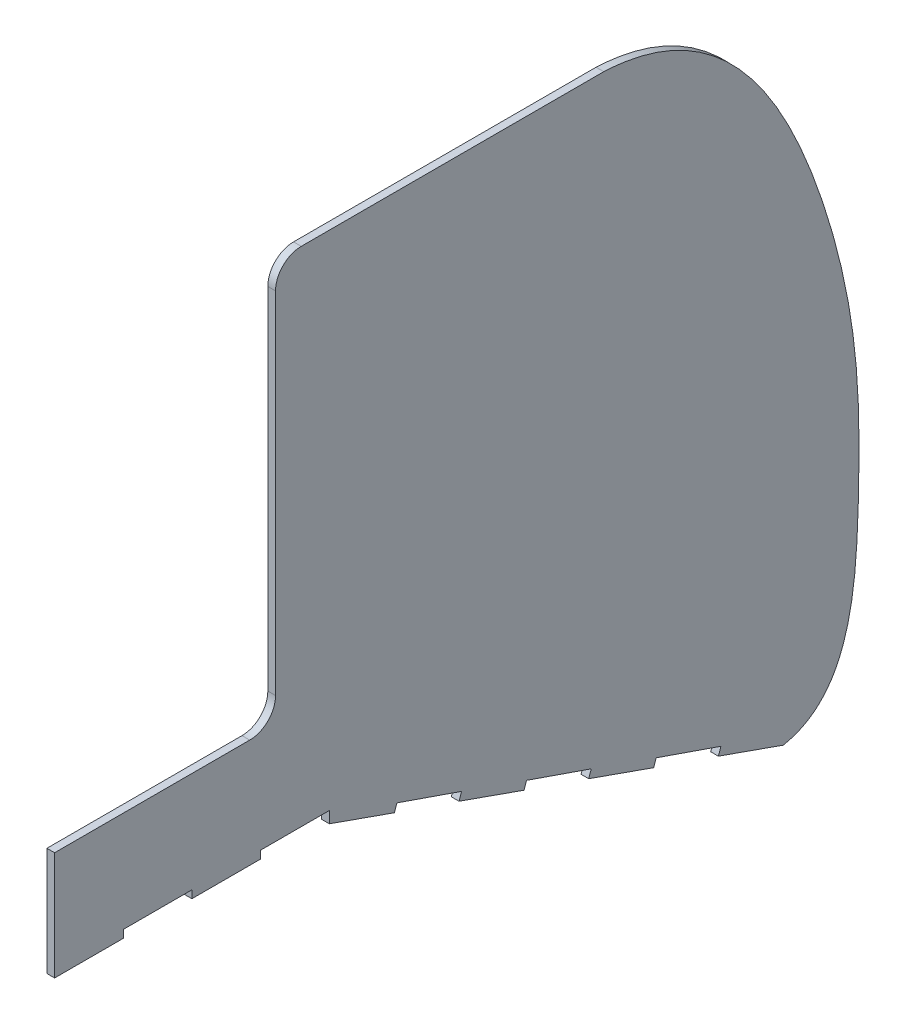
ISO-10303-21;
HEADER;
FILE_DESCRIPTION(('STEP AP214'),'2;1');
FILE_NAME('part.step','',(''),(''),'','','');
FILE_SCHEMA(('AUTOMOTIVE_DESIGN { 1 0 10303 214 1 1 1 1 }'));
ENDSEC;
DATA;
#1=APPLICATION_CONTEXT('core data for automotive mechanical design processes');
#2=APPLICATION_PROTOCOL_DEFINITION('international standard','automotive_design',2000,#1);
#3=PRODUCT_CONTEXT('',#1,'mechanical');
#4=PRODUCT('Part','Part','',(#3));
#5=PRODUCT_RELATED_PRODUCT_CATEGORY('part','',(#4));
#6=PRODUCT_DEFINITION_FORMATION('','',#4);
#7=PRODUCT_DEFINITION_CONTEXT('part definition',#1,'design');
#8=PRODUCT_DEFINITION('design','',#6,#7);
#9=PRODUCT_DEFINITION_SHAPE('','',#8);
#10=(LENGTH_UNIT() NAMED_UNIT(*) SI_UNIT(.MILLI.,.METRE.));
#11=(NAMED_UNIT(*) PLANE_ANGLE_UNIT() SI_UNIT($,.RADIAN.));
#12=(NAMED_UNIT(*) SI_UNIT($,.STERADIAN.) SOLID_ANGLE_UNIT());
#13=UNCERTAINTY_MEASURE_WITH_UNIT(LENGTH_MEASURE(1.E-05),#10,'distance_accuracy_value','');
#14=(GEOMETRIC_REPRESENTATION_CONTEXT(3) GLOBAL_UNCERTAINTY_ASSIGNED_CONTEXT((#13)) GLOBAL_UNIT_ASSIGNED_CONTEXT((#10,
#11,#12)) REPRESENTATION_CONTEXT('',''));
#15=CARTESIAN_POINT('',(0.,0.,0.));
#16=DIRECTION('',(0.,0.,1.));
#17=DIRECTION('',(1.,0.,0.));
#18=AXIS2_PLACEMENT_3D('',#15,#16,#17);
#19=CARTESIAN_POINT('',(3.,-35.4908915205804,4.87556999777367));
#20=DIRECTION('',(0.,-0.326907719308166,-0.945056264492614));
#21=DIRECTION('',(0.,0.945056264492614,-0.326907719308166));
#22=AXIS2_PLACEMENT_3D('',#19,#20,#21);
#23=PLANE('',#22);
#24=DIRECTION('',(0.,-0.945056264492614,0.326907719308166));
#25=VECTOR('',#24,1.);
#26=CARTESIAN_POINT('',(0.,-35.4908915205804,4.87556999777367));
#27=LINE('',#26,#25);
#28=CARTESIAN_POINT('',(0.,-35.4908915205804,4.87556999777367));
#29=VERTEX_POINT('',#28);
#30=CARTESIAN_POINT('',(0.,-38.3260603140583,5.85629315569817));
#31=VERTEX_POINT('',#30);
#32=EDGE_CURVE('E257',#29,#31,#27,.T.);
#33=ORIENTED_EDGE('',*,*,#32,.T.);
#34=DIRECTION('',(-1.,0.,0.));
#35=VECTOR('',#34,1.);
#36=CARTESIAN_POINT('',(3.,-38.3260603140583,5.85629315569817));
#37=LINE('',#36,#35);
#38=CARTESIAN_POINT('',(3.,-38.3260603140583,5.85629315569817));
#39=VERTEX_POINT('',#38);
#40=EDGE_CURVE('E11',#39,#31,#37,.T.);
#41=ORIENTED_EDGE('',*,*,#40,.F.);
#42=DIRECTION('',(0.,-0.945056264492614,0.326907719308166));
#43=VECTOR('',#42,1.);
#44=CARTESIAN_POINT('',(3.,-35.4908915205804,4.87556999777367));
#45=LINE('',#44,#43);
#46=CARTESIAN_POINT('',(3.,-35.4908915205804,4.87556999777367));
#47=VERTEX_POINT('',#46);
#48=EDGE_CURVE('E316',#47,#39,#45,.T.);
#49=ORIENTED_EDGE('',*,*,#48,.F.);
#50=DIRECTION('',(-1.,0.,0.));
#51=VECTOR('',#50,1.);
#52=CARTESIAN_POINT('',(3.,-35.4908915205804,4.87556999777367));
#53=LINE('',#52,#51);
#54=EDGE_CURVE('E253',#47,#29,#53,.T.);
#55=ORIENTED_EDGE('',*,*,#54,.T.);
#56=EDGE_LOOP('',(#33,#41,#49,#55));
#57=FACE_BOUND('',#56,.T.);
#58=ADVANCED_FACE('F41',(#57),#23,.F.);
#59=CARTESIAN_POINT('',(3.,-38.3260603140583,5.85629315569817));
#60=DIRECTION('',(0.,0.942978575575048,-0.332853430215842));
#61=DIRECTION('',(0.,0.332853430215842,0.942978575575049));
#62=AXIS2_PLACEMENT_3D('',#59,#60,#61);
#63=PLANE('',#62);
#64=DIRECTION('',(0.,-0.332853430215842,-0.942978575575048));
#65=VECTOR('',#64,1.);
#66=CARTESIAN_POINT('',(0.,-38.3260603140583,5.85629315569817));
#67=LINE('',#66,#65);
#68=CARTESIAN_POINT('',(0.,-47.2453418621063,-19.4121603010595));
#69=VERTEX_POINT('',#68);
#70=EDGE_CURVE('E260',#31,#69,#67,.T.);
#71=ORIENTED_EDGE('',*,*,#70,.T.);
#72=DIRECTION('',(-1.,0.,0.));
#73=VECTOR('',#72,1.);
#74=CARTESIAN_POINT('',(3.,-47.2453418621063,-19.4121603010595));
#75=LINE('',#74,#73);
#76=CARTESIAN_POINT('',(3.,-47.2453418621063,-19.4121603010595));
#77=VERTEX_POINT('',#76);
#78=EDGE_CURVE('E49',#77,#69,#75,.T.);
#79=ORIENTED_EDGE('',*,*,#78,.F.);
#80=DIRECTION('',(0.,-0.332853430215842,-0.942978575575048));
#81=VECTOR('',#80,1.);
#82=CARTESIAN_POINT('',(3.,-38.3260603140583,5.85629315569817));
#83=LINE('',#82,#81);
#84=EDGE_CURVE('E160',#39,#77,#83,.T.);
#85=ORIENTED_EDGE('',*,*,#84,.F.);
#86=ORIENTED_EDGE('',*,*,#40,.T.);
#87=EDGE_LOOP('',(#71,#79,#85,#86));
#88=FACE_BOUND('',#87,.T.);
#89=ADVANCED_FACE('F442',(#88),#63,.F.);
#90=CARTESIAN_POINT('',(3.,-47.2453418621063,-19.4121603010595));
#91=DIRECTION('',(0.,0.326907719308166,0.945056264492614));
#92=DIRECTION('',(0.,-0.945056264492614,0.326907719308166));
#93=AXIS2_PLACEMENT_3D('',#90,#91,#92);
#94=PLANE('',#93);
#95=DIRECTION('',(0.,0.945056264492614,-0.326907719308166));
#96=VECTOR('',#95,1.);
#97=CARTESIAN_POINT('',(0.,-47.2453418621063,-19.4121603010595));
#98=LINE('',#97,#96);
#99=CARTESIAN_POINT('',(0.,-44.4101730686285,-20.392883458984));
#100=VERTEX_POINT('',#99);
#101=EDGE_CURVE('E262',#69,#100,#98,.T.);
#102=ORIENTED_EDGE('',*,*,#101,.T.);
#103=DIRECTION('',(-1.,0.,0.));
#104=VECTOR('',#103,1.);
#105=CARTESIAN_POINT('',(3.,-44.4101730686285,-20.392883458984));
#106=LINE('',#105,#104);
#107=CARTESIAN_POINT('',(3.,-44.4101730686285,-20.392883458984));
#108=VERTEX_POINT('',#107);
#109=EDGE_CURVE('E383',#108,#100,#106,.T.);
#110=ORIENTED_EDGE('',*,*,#109,.F.);
#111=DIRECTION('',(0.,0.945056264492614,-0.326907719308166));
#112=VECTOR('',#111,1.);
#113=CARTESIAN_POINT('',(3.,-47.2453418621063,-19.4121603010595));
#114=LINE('',#113,#112);
#115=EDGE_CURVE('E391',#77,#108,#114,.T.);
#116=ORIENTED_EDGE('',*,*,#115,.F.);
#117=ORIENTED_EDGE('',*,*,#78,.T.);
#118=EDGE_LOOP('',(#102,#110,#116,#117));
#119=FACE_BOUND('',#118,.T.);
#120=ADVANCED_FACE('F389',(#119),#94,.F.);
#121=CARTESIAN_POINT('',(3.,-44.4101730686285,-20.392883458984));
#122=DIRECTION('',(0.,0.945056264492614,-0.326907719308165));
#123=DIRECTION('',(0.,0.326907719308165,0.945056264492614));
#124=AXIS2_PLACEMENT_3D('',#121,#122,#123);
#125=PLANE('',#124);
#126=DIRECTION('',(0.,-0.326907719308165,-0.945056264492614));
#127=VECTOR('',#126,1.);
#128=CARTESIAN_POINT('',(0.,-44.4101730686285,-20.392883458984));
#129=LINE('',#128,#127);
#130=CARTESIAN_POINT('',(0.,-53.1147946852733,-45.5570405069039));
#131=VERTEX_POINT('',#130);
#132=EDGE_CURVE('E264',#100,#131,#129,.T.);
#133=ORIENTED_EDGE('',*,*,#132,.T.);
#134=DIRECTION('',(-1.,0.,0.));
#135=VECTOR('',#134,1.);
#136=CARTESIAN_POINT('',(3.,-53.1147946852733,-45.5570405069039));
#137=LINE('',#136,#135);
#138=CARTESIAN_POINT('',(3.,-53.1147946852733,-45.5570405069039));
#139=VERTEX_POINT('',#138);
#140=EDGE_CURVE('E380',#139,#131,#137,.T.);
#141=ORIENTED_EDGE('',*,*,#140,.F.);
#142=DIRECTION('',(0.,-0.326907719308165,-0.945056264492614));
#143=VECTOR('',#142,1.);
#144=CARTESIAN_POINT('',(3.,-44.4101730686285,-20.392883458984));
#145=LINE('',#144,#143);
#146=EDGE_CURVE('E409',#108,#139,#145,.T.);
#147=ORIENTED_EDGE('',*,*,#146,.F.);
#148=ORIENTED_EDGE('',*,*,#109,.T.);
#149=EDGE_LOOP('',(#133,#141,#147,#148));
#150=FACE_BOUND('',#149,.T.);
#151=ADVANCED_FACE('F400',(#150),#125,.F.);
#152=CARTESIAN_POINT('',(3.,-53.1147946852733,-45.5570405069039));
#153=DIRECTION('',(0.,-0.326907719308179,-0.945056264492609));
#154=DIRECTION('',(0.,0.945056264492609,-0.32690771930818));
#155=AXIS2_PLACEMENT_3D('',#152,#153,#154);
#156=PLANE('',#155);
#157=DIRECTION('',(0.,-0.945056264492609,0.32690771930818));
#158=VECTOR('',#157,1.);
#159=CARTESIAN_POINT('',(0.,-53.1147946852733,-45.5570405069039));
#160=LINE('',#159,#158);
#161=CARTESIAN_POINT('',(0.,-55.9499634787511,-44.5763173489793));
#162=VERTEX_POINT('',#161);
#163=EDGE_CURVE('E266',#131,#162,#160,.T.);
#164=ORIENTED_EDGE('',*,*,#163,.T.);
#165=DIRECTION('',(-1.,0.,0.));
#166=VECTOR('',#165,1.);
#167=CARTESIAN_POINT('',(3.,-55.9499634787511,-44.5763173489793));
#168=LINE('',#167,#166);
#169=CARTESIAN_POINT('',(3.,-55.9499634787511,-44.5763173489793));
#170=VERTEX_POINT('',#169);
#171=EDGE_CURVE('E377',#170,#162,#168,.T.);
#172=ORIENTED_EDGE('',*,*,#171,.F.);
#173=DIRECTION('',(0.,-0.945056264492609,0.32690771930818));
#174=VECTOR('',#173,1.);
#175=CARTESIAN_POINT('',(3.,-53.1147946852733,-45.5570405069039));
#176=LINE('',#175,#174);
#177=EDGE_CURVE('E406',#139,#170,#176,.T.);
#178=ORIENTED_EDGE('',*,*,#177,.F.);
#179=ORIENTED_EDGE('',*,*,#140,.T.);
#180=EDGE_LOOP('',(#164,#172,#178,#179));
#181=FACE_BOUND('',#180,.T.);
#182=ADVANCED_FACE('F404',(#181),#156,.F.);
#183=CARTESIAN_POINT('',(3.,-55.9499634787511,-44.5763173489793));
#184=DIRECTION('',(0.,0.942978575575048,-0.332853430215842));
#185=DIRECTION('',(0.,0.332853430215842,0.942978575575049));
#186=AXIS2_PLACEMENT_3D('',#183,#184,#185);
#187=PLANE('',#186);
#188=DIRECTION('',(0.,-0.332853430215842,-0.942978575575049));
#189=VECTOR('',#188,1.);
#190=CARTESIAN_POINT('',(0.,-55.9499634787511,-44.5763173489793));
#191=LINE('',#190,#189);
#192=CARTESIAN_POINT('',(0.,-64.8692450267991,-69.844770805737));
#193=VERTEX_POINT('',#192);
#194=EDGE_CURVE('E268',#162,#193,#191,.T.);
#195=ORIENTED_EDGE('',*,*,#194,.T.);
#196=DIRECTION('',(-1.,0.,0.));
#197=VECTOR('',#196,1.);
#198=CARTESIAN_POINT('',(3.,-64.8692450267991,-69.844770805737));
#199=LINE('',#198,#197);
#200=CARTESIAN_POINT('',(3.,-64.8692450267991,-69.844770805737));
#201=VERTEX_POINT('',#200);
#202=EDGE_CURVE('E374',#201,#193,#199,.T.);
#203=ORIENTED_EDGE('',*,*,#202,.F.);
#204=DIRECTION('',(0.,-0.332853430215842,-0.942978575575049));
#205=VECTOR('',#204,1.);
#206=CARTESIAN_POINT('',(3.,-55.9499634787511,-44.5763173489793));
#207=LINE('',#206,#205);
#208=EDGE_CURVE('E408',#170,#201,#207,.T.);
#209=ORIENTED_EDGE('',*,*,#208,.F.);
#210=ORIENTED_EDGE('',*,*,#171,.T.);
#211=EDGE_LOOP('',(#195,#203,#209,#210));
#212=FACE_BOUND('',#211,.T.);
#213=ADVANCED_FACE('F431',(#212),#187,.F.);
#214=CARTESIAN_POINT('',(3.,-64.8692450267991,-69.844770805737));
#215=CARTESIAN_POINT('',(3.,-59.9103879295342,-95.6249766931962));
#216=CARTESIAN_POINT('',(3.,0.303625018277105,-100.05299309198));
#217=CARTESIAN_POINT('',(3.,59.2088369906112,-99.1821701786262));
#218=CARTESIAN_POINT('',(3.,137.404046631828,-79.8848755295219));
#219=CARTESIAN_POINT('',(3.,194.855720742385,-46.196792572307));
#220=CARTESIAN_POINT('',(3.,196.921746015327,0.));
#221=B_SPLINE_CURVE_WITH_KNOTS('',3,(#214,#215,#216,#217,#218,#219,#220),.UNSPECIFIED.,.F.,.F.,
(4,1,1,1,4),(0.,0.235631157854146,0.435765938633693,0.605393772524314,1.),.UNSPECIFIED.);
#222=DIRECTION('',(-1.,0.,0.));
#223=VECTOR('',#222,1.);
#224=SURFACE_OF_LINEAR_EXTRUSION('',#221,#223);
#225=CARTESIAN_POINT('',(0.,-64.8692450267991,-69.844770805737));
#226=CARTESIAN_POINT('',(0.,-59.9103879295342,-95.6249766931962));
#227=CARTESIAN_POINT('',(0.,0.303625018277105,-100.05299309198));
#228=CARTESIAN_POINT('',(0.,59.2088369906112,-99.1821701786262));
#229=CARTESIAN_POINT('',(0.,137.404046631828,-79.8848755295219));
#230=CARTESIAN_POINT('',(0.,194.855720742385,-46.196792572307));
#231=CARTESIAN_POINT('',(0.,196.921746015327,0.));
#232=B_SPLINE_CURVE_WITH_KNOTS('',3,(#225,#226,#227,#228,#229,#230,#231),.UNSPECIFIED.,.F.,.F.,
(4,1,1,1,4),(0.,0.235631157854146,0.435765938633693,0.605393772524314,1.),.UNSPECIFIED.);
#233=CARTESIAN_POINT('',(0.,196.921746015327,0.));
#234=VERTEX_POINT('',#233);
#235=EDGE_CURVE('E270',#193,#234,#232,.T.);
#236=ORIENTED_EDGE('',*,*,#235,.T.);
#237=DIRECTION('',(-1.,0.,0.));
#238=VECTOR('',#237,1.);
#239=CARTESIAN_POINT('',(3.,196.921746015327,0.));
#240=LINE('',#239,#238);
#241=CARTESIAN_POINT('',(3.,196.921746015327,0.));
#242=VERTEX_POINT('',#241);
#243=EDGE_CURVE('E371',#242,#234,#240,.T.);
#244=ORIENTED_EDGE('',*,*,#243,.F.);
#245=EDGE_CURVE('E411',#201,#242,#221,.T.);
#246=ORIENTED_EDGE('',*,*,#245,.F.);
#247=ORIENTED_EDGE('',*,*,#202,.T.);
#248=EDGE_LOOP('',(#236,#244,#246,#247));
#249=FACE_BOUND('',#248,.T.);
#250=ADVANCED_FACE('F426',(#249),#224,.F.);
#251=CARTESIAN_POINT('',(3.,196.921746015327,117.673281540121));
#252=DIRECTION('',(0.,-1.,0.));
#253=DIRECTION('',(0.,0.,-1.));
#254=AXIS2_PLACEMENT_3D('',#251,#252,#253);
#255=PLANE('',#254);
#256=DIRECTION('',(0.,0.,1.));
#257=VECTOR('',#256,1.);
#258=CARTESIAN_POINT('',(0.,196.921746015327,117.673281540121));
#259=LINE('',#258,#257);
#260=CARTESIAN_POINT('',(0.,196.921746015327,117.673281540121));
#261=VERTEX_POINT('',#260);
#262=EDGE_CURVE('E274',#234,#261,#259,.T.);
#263=ORIENTED_EDGE('',*,*,#262,.T.);
#264=DIRECTION('',(-1.,0.,0.));
#265=VECTOR('',#264,1.);
#266=CARTESIAN_POINT('',(3.,196.921746015327,117.673281540121));
#267=LINE('',#266,#265);
#268=CARTESIAN_POINT('',(3.,196.921746015327,117.673281540121));
#269=VERTEX_POINT('',#268);
#270=EDGE_CURVE('E368',#269,#261,#267,.T.);
#271=ORIENTED_EDGE('',*,*,#270,.F.);
#272=DIRECTION('',(0.,0.,1.));
#273=VECTOR('',#272,1.);
#274=CARTESIAN_POINT('',(3.,196.921746015327,117.673281540121));
#275=LINE('',#274,#273);
#276=EDGE_CURVE('E420',#242,#269,#275,.T.);
#277=ORIENTED_EDGE('',*,*,#276,.F.);
#278=ORIENTED_EDGE('',*,*,#243,.T.);
#279=EDGE_LOOP('',(#263,#271,#277,#278));
#280=FACE_BOUND('',#279,.T.);
#281=ADVANCED_FACE('F430',(#280),#255,.F.);
#282=CARTESIAN_POINT('',(3.,186.921746015327,117.673281540121));
#283=DIRECTION('',(-1.,0.,0.));
#284=DIRECTION('',(0.,0.,1.));
#285=AXIS2_PLACEMENT_3D('',#282,#283,#284);
#286=CYLINDRICAL_SURFACE('',#285,10.);
#287=CARTESIAN_POINT('',(0.,186.921746015327,117.673281540121));
#288=DIRECTION('',(1.,0.,0.));
#289=DIRECTION('',(0.,0.,1.));
#290=AXIS2_PLACEMENT_3D('',#287,#288,#289);
#291=CIRCLE('',#290,10.);
#292=CARTESIAN_POINT('',(0.,186.921746015327,127.673281540121));
#293=VERTEX_POINT('',#292);
#294=EDGE_CURVE('E279',#261,#293,#291,.T.);
#295=ORIENTED_EDGE('',*,*,#294,.T.);
#296=DIRECTION('',(-1.,0.,0.));
#297=VECTOR('',#296,1.);
#298=CARTESIAN_POINT('',(3.,186.921746015327,127.673281540121));
#299=LINE('',#298,#297);
#300=CARTESIAN_POINT('',(3.,186.921746015327,127.673281540121));
#301=VERTEX_POINT('',#300);
#302=EDGE_CURVE('E365',#301,#293,#299,.T.);
#303=ORIENTED_EDGE('',*,*,#302,.F.);
#304=CARTESIAN_POINT('',(3.,186.921746015327,117.673281540121));
#305=DIRECTION('',(1.,0.,0.));
#306=DIRECTION('',(0.,0.,1.));
#307=AXIS2_PLACEMENT_3D('',#304,#305,#306);
#308=CIRCLE('',#307,10.);
#309=EDGE_CURVE('E549',#269,#301,#308,.T.);
#310=ORIENTED_EDGE('',*,*,#309,.F.);
#311=ORIENTED_EDGE('',*,*,#270,.T.);
#312=EDGE_LOOP('',(#295,#303,#310,#311));
#313=FACE_BOUND('',#312,.T.);
#314=ADVANCED_FACE('F548',(#313),#286,.T.);
#315=CARTESIAN_POINT('',(3.,50.6216316060485,127.673281540121));
#316=DIRECTION('',(0.,0.,-1.));
#317=DIRECTION('',(0.,1.,0.));
#318=AXIS2_PLACEMENT_3D('',#315,#316,#317);
#319=PLANE('',#318);
#320=DIRECTION('',(0.,-1.,0.));
#321=VECTOR('',#320,1.);
#322=CARTESIAN_POINT('',(0.,50.6216316060485,127.673281540121));
#323=LINE('',#322,#321);
#324=CARTESIAN_POINT('',(0.,50.6216316060485,127.673281540121));
#325=VERTEX_POINT('',#324);
#326=EDGE_CURVE('E281',#293,#325,#323,.T.);
#327=ORIENTED_EDGE('',*,*,#326,.T.);
#328=DIRECTION('',(-1.,0.,0.));
#329=VECTOR('',#328,1.);
#330=CARTESIAN_POINT('',(3.,50.6216316060485,127.673281540121));
#331=LINE('',#330,#329);
#332=CARTESIAN_POINT('',(3.,50.6216316060485,127.673281540121));
#333=VERTEX_POINT('',#332);
#334=EDGE_CURVE('E362',#333,#325,#331,.T.);
#335=ORIENTED_EDGE('',*,*,#334,.F.);
#336=DIRECTION('',(0.,-1.,0.));
#337=VECTOR('',#336,1.);
#338=CARTESIAN_POINT('',(3.,50.6216316060485,127.673281540121));
#339=LINE('',#338,#337);
#340=EDGE_CURVE('E545',#301,#333,#339,.T.);
#341=ORIENTED_EDGE('',*,*,#340,.F.);
#342=ORIENTED_EDGE('',*,*,#302,.T.);
#343=EDGE_LOOP('',(#327,#335,#341,#342));
#344=FACE_BOUND('',#343,.T.);
#345=ADVANCED_FACE('F542',(#344),#319,.F.);
#346=CARTESIAN_POINT('',(3.,50.6216316060485,137.673281540121));
#347=DIRECTION('',(-1.,0.,0.));
#348=DIRECTION('',(0.,0.,1.));
#349=AXIS2_PLACEMENT_3D('',#346,#347,#348);
#350=CYLINDRICAL_SURFACE('',#349,10.);
#351=CARTESIAN_POINT('',(0.,50.6216316060485,137.673281540121));
#352=DIRECTION('',(-1.,0.,0.));
#353=DIRECTION('',(0.,0.,-1.));
#354=AXIS2_PLACEMENT_3D('',#351,#352,#353);
#355=CIRCLE('',#354,10.);
#356=CARTESIAN_POINT('',(0.,40.6217460153273,137.721116386061));
#357=VERTEX_POINT('',#356);
#358=EDGE_CURVE('E283',#325,#357,#355,.T.);
#359=ORIENTED_EDGE('',*,*,#358,.T.);
#360=DIRECTION('',(-1.,0.,0.));
#361=VECTOR('',#360,1.);
#362=CARTESIAN_POINT('',(3.,40.6217460153273,137.721116386061));
#363=LINE('',#362,#361);
#364=CARTESIAN_POINT('',(3.,40.6217460153273,137.721116386061));
#365=VERTEX_POINT('',#364);
#366=EDGE_CURVE('E359',#365,#357,#363,.T.);
#367=ORIENTED_EDGE('',*,*,#366,.F.);
#368=CARTESIAN_POINT('',(3.,50.6216316060485,137.673281540121));
#369=DIRECTION('',(-1.,0.,0.));
#370=DIRECTION('',(0.,0.,-1.));
#371=AXIS2_PLACEMENT_3D('',#368,#369,#370);
#372=CIRCLE('',#371,10.);
#373=EDGE_CURVE('E536',#333,#365,#372,.T.);
#374=ORIENTED_EDGE('',*,*,#373,.F.);
#375=ORIENTED_EDGE('',*,*,#334,.T.);
#376=EDGE_LOOP('',(#359,#367,#374,#375));
#377=FACE_BOUND('',#376,.T.);
#378=ADVANCED_FACE('F535',(#377),#350,.F.);
#379=CARTESIAN_POINT('',(3.,40.6217460153273,213.6));
#380=DIRECTION('',(0.,-1.,0.));
#381=DIRECTION('',(0.,0.,-1.));
#382=AXIS2_PLACEMENT_3D('',#379,#380,#381);
#383=PLANE('',#382);
#384=DIRECTION('',(0.,0.,1.));
#385=VECTOR('',#384,1.);
#386=CARTESIAN_POINT('',(0.,40.6217460153273,213.6));
#387=LINE('',#386,#385);
#388=CARTESIAN_POINT('',(0.,40.6217460153273,213.6));
#389=VERTEX_POINT('',#388);
#390=EDGE_CURVE('E285',#357,#389,#387,.T.);
#391=ORIENTED_EDGE('',*,*,#390,.T.);
#392=DIRECTION('',(-1.,0.,0.));
#393=VECTOR('',#392,1.);
#394=CARTESIAN_POINT('',(3.,40.6217460153273,213.6));
#395=LINE('',#394,#393);
#396=CARTESIAN_POINT('',(3.,40.6217460153273,213.6));
#397=VERTEX_POINT('',#396);
#398=EDGE_CURVE('E356',#397,#389,#395,.T.);
#399=ORIENTED_EDGE('',*,*,#398,.F.);
#400=DIRECTION('',(0.,0.,1.));
#401=VECTOR('',#400,1.);
#402=CARTESIAN_POINT('',(3.,40.6217460153273,213.6));
#403=LINE('',#402,#401);
#404=EDGE_CURVE('E531',#365,#397,#403,.T.);
#405=ORIENTED_EDGE('',*,*,#404,.F.);
#406=ORIENTED_EDGE('',*,*,#366,.T.);
#407=EDGE_LOOP('',(#391,#399,#405,#406));
#408=FACE_BOUND('',#407,.T.);
#409=ADVANCED_FACE('F530',(#408),#383,.F.);
#410=CARTESIAN_POINT('',(3.,-1.5782539846727,213.6));
#411=DIRECTION('',(0.,0.,-1.));
#412=DIRECTION('',(-1.,0.,0.));
#413=AXIS2_PLACEMENT_3D('',#410,#411,#412);
#414=PLANE('',#413);
#415=DIRECTION('',(0.,-1.,0.));
#416=VECTOR('',#415,1.);
#417=CARTESIAN_POINT('',(0.,-1.5782539846727,213.6));
#418=LINE('',#417,#416);
#419=CARTESIAN_POINT('',(0.,-1.5782539846727,213.6));
#420=VERTEX_POINT('',#419);
#421=EDGE_CURVE('E287',#389,#420,#418,.T.);
#422=ORIENTED_EDGE('',*,*,#421,.T.);
#423=DIRECTION('',(-1.,0.,0.));
#424=VECTOR('',#423,1.);
#425=CARTESIAN_POINT('',(3.,-1.5782539846727,213.6));
#426=LINE('',#425,#424);
#427=CARTESIAN_POINT('',(3.,-1.5782539846727,213.6));
#428=VERTEX_POINT('',#427);
#429=EDGE_CURVE('E353',#428,#420,#426,.T.);
#430=ORIENTED_EDGE('',*,*,#429,.F.);
#431=DIRECTION('',(0.,-1.,0.));
#432=VECTOR('',#431,1.);
#433=CARTESIAN_POINT('',(3.,-1.5782539846727,213.6));
#434=LINE('',#433,#432);
#435=EDGE_CURVE('E527',#397,#428,#434,.T.);
#436=ORIENTED_EDGE('',*,*,#435,.F.);
#437=ORIENTED_EDGE('',*,*,#398,.T.);
#438=EDGE_LOOP('',(#422,#430,#436,#437));
#439=FACE_BOUND('',#438,.T.);
#440=ADVANCED_FACE('F524',(#439),#414,.F.);
#441=CARTESIAN_POINT('',(3.,-1.5782539846727,186.9));
#442=DIRECTION('',(0.,1.,0.));
#443=DIRECTION('',(0.,0.,1.));
#444=AXIS2_PLACEMENT_3D('',#441,#442,#443);
#445=PLANE('',#444);
#446=DIRECTION('',(0.,0.,-1.));
#447=VECTOR('',#446,1.);
#448=CARTESIAN_POINT('',(0.,-1.5782539846727,186.9));
#449=LINE('',#448,#447);
#450=CARTESIAN_POINT('',(0.,-1.5782539846727,186.9));
#451=VERTEX_POINT('',#450);
#452=EDGE_CURVE('E289',#420,#451,#449,.T.);
#453=ORIENTED_EDGE('',*,*,#452,.T.);
#454=DIRECTION('',(-1.,0.,0.));
#455=VECTOR('',#454,1.);
#456=CARTESIAN_POINT('',(3.,-1.5782539846727,186.9));
#457=LINE('',#456,#455);
#458=CARTESIAN_POINT('',(3.,-1.5782539846727,186.9));
#459=VERTEX_POINT('',#458);
#460=EDGE_CURVE('E350',#459,#451,#457,.T.);
#461=ORIENTED_EDGE('',*,*,#460,.F.);
#462=DIRECTION('',(0.,0.,-1.));
#463=VECTOR('',#462,1.);
#464=CARTESIAN_POINT('',(3.,-1.5782539846727,186.9));
#465=LINE('',#464,#463);
#466=EDGE_CURVE('E518',#428,#459,#465,.T.);
#467=ORIENTED_EDGE('',*,*,#466,.F.);
#468=ORIENTED_EDGE('',*,*,#429,.T.);
#469=EDGE_LOOP('',(#453,#461,#467,#468));
#470=FACE_BOUND('',#469,.T.);
#471=ADVANCED_FACE('F517',(#470),#445,.F.);
#472=CARTESIAN_POINT('',(3.,1.4217460153273,186.9));
#473=DIRECTION('',(0.,0.,1.));
#474=DIRECTION('',(1.,0.,0.));
#475=AXIS2_PLACEMENT_3D('',#472,#473,#474);
#476=PLANE('',#475);
#477=DIRECTION('',(0.,1.,0.));
#478=VECTOR('',#477,1.);
#479=CARTESIAN_POINT('',(0.,1.4217460153273,186.9));
#480=LINE('',#479,#478);
#481=CARTESIAN_POINT('',(0.,1.4217460153273,186.9));
#482=VERTEX_POINT('',#481);
#483=EDGE_CURVE('E291',#451,#482,#480,.T.);
#484=ORIENTED_EDGE('',*,*,#483,.T.);
#485=DIRECTION('',(-1.,0.,0.));
#486=VECTOR('',#485,1.);
#487=CARTESIAN_POINT('',(3.,1.4217460153273,186.9));
#488=LINE('',#487,#486);
#489=CARTESIAN_POINT('',(3.,1.4217460153273,186.9));
#490=VERTEX_POINT('',#489);
#491=EDGE_CURVE('E347',#490,#482,#488,.T.);
#492=ORIENTED_EDGE('',*,*,#491,.F.);
#493=DIRECTION('',(0.,1.,0.));
#494=VECTOR('',#493,1.);
#495=CARTESIAN_POINT('',(3.,1.4217460153273,186.9));
#496=LINE('',#495,#494);
#497=EDGE_CURVE('E513',#459,#490,#496,.T.);
#498=ORIENTED_EDGE('',*,*,#497,.F.);
#499=ORIENTED_EDGE('',*,*,#460,.T.);
#500=EDGE_LOOP('',(#484,#492,#498,#499));
#501=FACE_BOUND('',#500,.T.);
#502=ADVANCED_FACE('F512',(#501),#476,.F.);
#503=CARTESIAN_POINT('',(3.,1.42174601532731,160.2));
#504=DIRECTION('',(0.,1.,0.));
#505=DIRECTION('',(0.,0.,1.));
#506=AXIS2_PLACEMENT_3D('',#503,#504,#505);
#507=PLANE('',#506);
#508=DIRECTION('',(0.,0.,-1.));
#509=VECTOR('',#508,1.);
#510=CARTESIAN_POINT('',(0.,1.42174601532731,160.2));
#511=LINE('',#510,#509);
#512=CARTESIAN_POINT('',(0.,1.42174601532731,160.2));
#513=VERTEX_POINT('',#512);
#514=EDGE_CURVE('E293',#482,#513,#511,.T.);
#515=ORIENTED_EDGE('',*,*,#514,.T.);
#516=DIRECTION('',(-1.,0.,0.));
#517=VECTOR('',#516,1.);
#518=CARTESIAN_POINT('',(3.,1.42174601532731,160.2));
#519=LINE('',#518,#517);
#520=CARTESIAN_POINT('',(3.,1.42174601532731,160.2));
#521=VERTEX_POINT('',#520);
#522=EDGE_CURVE('E344',#521,#513,#519,.T.);
#523=ORIENTED_EDGE('',*,*,#522,.F.);
#524=DIRECTION('',(0.,0.,-1.));
#525=VECTOR('',#524,1.);
#526=CARTESIAN_POINT('',(3.,1.42174601532731,160.2));
#527=LINE('',#526,#525);
#528=EDGE_CURVE('E509',#490,#521,#527,.T.);
#529=ORIENTED_EDGE('',*,*,#528,.F.);
#530=ORIENTED_EDGE('',*,*,#491,.T.);
#531=EDGE_LOOP('',(#515,#523,#529,#530));
#532=FACE_BOUND('',#531,.T.);
#533=ADVANCED_FACE('F506',(#532),#507,.F.);
#534=CARTESIAN_POINT('',(3.,-1.57825398467269,160.2));
#535=DIRECTION('',(0.,0.,-1.));
#536=DIRECTION('',(-1.,0.,0.));
#537=AXIS2_PLACEMENT_3D('',#534,#535,#536);
#538=PLANE('',#537);
#539=DIRECTION('',(0.,-1.,0.));
#540=VECTOR('',#539,1.);
#541=CARTESIAN_POINT('',(0.,-1.57825398467269,160.2));
#542=LINE('',#541,#540);
#543=CARTESIAN_POINT('',(0.,-1.57825398467269,160.2));
#544=VERTEX_POINT('',#543);
#545=EDGE_CURVE('E295',#513,#544,#542,.T.);
#546=ORIENTED_EDGE('',*,*,#545,.T.);
#547=DIRECTION('',(-1.,0.,0.));
#548=VECTOR('',#547,1.);
#549=CARTESIAN_POINT('',(3.,-1.57825398467269,160.2));
#550=LINE('',#549,#548);
#551=CARTESIAN_POINT('',(3.,-1.57825398467269,160.2));
#552=VERTEX_POINT('',#551);
#553=EDGE_CURVE('E341',#552,#544,#550,.T.);
#554=ORIENTED_EDGE('',*,*,#553,.F.);
#555=DIRECTION('',(0.,-1.,0.));
#556=VECTOR('',#555,1.);
#557=CARTESIAN_POINT('',(3.,-1.57825398467269,160.2));
#558=LINE('',#557,#556);
#559=EDGE_CURVE('E500',#521,#552,#558,.T.);
#560=ORIENTED_EDGE('',*,*,#559,.F.);
#561=ORIENTED_EDGE('',*,*,#522,.T.);
#562=EDGE_LOOP('',(#546,#554,#560,#561));
#563=FACE_BOUND('',#562,.T.);
#564=ADVANCED_FACE('F499',(#563),#538,.F.);
#565=CARTESIAN_POINT('',(3.,-1.57825398467269,133.5));
#566=DIRECTION('',(0.,1.,0.));
#567=DIRECTION('',(0.,0.,1.));
#568=AXIS2_PLACEMENT_3D('',#565,#566,#567);
#569=PLANE('',#568);
#570=DIRECTION('',(0.,0.,-1.));
#571=VECTOR('',#570,1.);
#572=CARTESIAN_POINT('',(0.,-1.57825398467269,133.5));
#573=LINE('',#572,#571);
#574=CARTESIAN_POINT('',(0.,-1.57825398467269,133.5));
#575=VERTEX_POINT('',#574);
#576=EDGE_CURVE('E297',#544,#575,#573,.T.);
#577=ORIENTED_EDGE('',*,*,#576,.T.);
#578=DIRECTION('',(-1.,0.,0.));
#579=VECTOR('',#578,1.);
#580=CARTESIAN_POINT('',(3.,-1.57825398467269,133.5));
#581=LINE('',#580,#579);
#582=CARTESIAN_POINT('',(3.,-1.57825398467269,133.5));
#583=VERTEX_POINT('',#582);
#584=EDGE_CURVE('E338',#583,#575,#581,.T.);
#585=ORIENTED_EDGE('',*,*,#584,.F.);
#586=DIRECTION('',(0.,0.,-1.));
#587=VECTOR('',#586,1.);
#588=CARTESIAN_POINT('',(3.,-1.57825398467269,133.5));
#589=LINE('',#588,#587);
#590=EDGE_CURVE('E495',#552,#583,#589,.T.);
#591=ORIENTED_EDGE('',*,*,#590,.F.);
#592=ORIENTED_EDGE('',*,*,#553,.T.);
#593=EDGE_LOOP('',(#577,#585,#591,#592));
#594=FACE_BOUND('',#593,.T.);
#595=ADVANCED_FACE('F494',(#594),#569,.F.);
#596=CARTESIAN_POINT('',(3.,1.42174601532731,133.5));
#597=DIRECTION('',(0.,0.,1.));
#598=DIRECTION('',(1.,0.,0.));
#599=AXIS2_PLACEMENT_3D('',#596,#597,#598);
#600=PLANE('',#599);
#601=DIRECTION('',(0.,1.,0.));
#602=VECTOR('',#601,1.);
#603=CARTESIAN_POINT('',(0.,1.42174601532731,133.5));
#604=LINE('',#603,#602);
#605=CARTESIAN_POINT('',(0.,1.42174601532731,133.5));
#606=VERTEX_POINT('',#605);
#607=EDGE_CURVE('E299',#575,#606,#604,.T.);
#608=ORIENTED_EDGE('',*,*,#607,.T.);
#609=DIRECTION('',(-1.,0.,0.));
#610=VECTOR('',#609,1.);
#611=CARTESIAN_POINT('',(3.,1.42174601532731,133.5));
#612=LINE('',#611,#610);
#613=CARTESIAN_POINT('',(3.,1.42174601532731,133.5));
#614=VERTEX_POINT('',#613);
#615=EDGE_CURVE('E335',#614,#606,#612,.T.);
#616=ORIENTED_EDGE('',*,*,#615,.F.);
#617=DIRECTION('',(0.,1.,0.));
#618=VECTOR('',#617,1.);
#619=CARTESIAN_POINT('',(3.,1.42174601532731,133.5));
#620=LINE('',#619,#618);
#621=EDGE_CURVE('E491',#583,#614,#620,.T.);
#622=ORIENTED_EDGE('',*,*,#621,.F.);
#623=ORIENTED_EDGE('',*,*,#584,.T.);
#624=EDGE_LOOP('',(#608,#616,#622,#623));
#625=FACE_BOUND('',#624,.T.);
#626=ADVANCED_FACE('F488',(#625),#600,.F.);
#627=CARTESIAN_POINT('',(3.,1.42174601532731,106.721514165053));
#628=DIRECTION('',(0.,1.,0.));
#629=DIRECTION('',(0.,0.,1.));
#630=AXIS2_PLACEMENT_3D('',#627,#628,#629);
#631=PLANE('',#630);
#632=DIRECTION('',(0.,0.,-1.));
#633=VECTOR('',#632,1.);
#634=CARTESIAN_POINT('',(0.,1.42174601532731,106.721514165053));
#635=LINE('',#634,#633);
#636=CARTESIAN_POINT('',(0.,1.42174601532731,106.721514165053));
#637=VERTEX_POINT('',#636);
#638=EDGE_CURVE('E301',#606,#637,#635,.T.);
#639=ORIENTED_EDGE('',*,*,#638,.T.);
#640=DIRECTION('',(-1.,0.,0.));
#641=VECTOR('',#640,1.);
#642=CARTESIAN_POINT('',(3.,1.42174601532731,106.721514165053));
#643=LINE('',#642,#641);
#644=CARTESIAN_POINT('',(3.,1.42174601532731,106.721514165053));
#645=VERTEX_POINT('',#644);
#646=EDGE_CURVE('E332',#645,#637,#643,.T.);
#647=ORIENTED_EDGE('',*,*,#646,.F.);
#648=DIRECTION('',(0.,0.,-1.));
#649=VECTOR('',#648,1.);
#650=CARTESIAN_POINT('',(3.,1.42174601532731,106.721514165053));
#651=LINE('',#650,#649);
#652=EDGE_CURVE('E482',#614,#645,#651,.T.);
#653=ORIENTED_EDGE('',*,*,#652,.F.);
#654=ORIENTED_EDGE('',*,*,#615,.T.);
#655=EDGE_LOOP('',(#639,#647,#653,#654));
#656=FACE_BOUND('',#655,.T.);
#657=ADVANCED_FACE('F481',(#656),#631,.F.);
#658=CARTESIAN_POINT('',(3.,1.42174601532731,106.721514165053));
#659=DIRECTION('',(0.,0.,-1.));
#660=DIRECTION('',(0.,1.,0.));
#661=AXIS2_PLACEMENT_3D('',#658,#659,#660);
#662=PLANE('',#661);
#663=DIRECTION('',(0.,-1.,0.));
#664=VECTOR('',#663,1.);
#665=CARTESIAN_POINT('',(0.,1.42174601532731,106.721514165053));
#666=LINE('',#665,#664);
#667=CARTESIAN_POINT('',(0.,-3.07825398467269,106.721514165053));
#668=VERTEX_POINT('',#667);
#669=EDGE_CURVE('E303',#637,#668,#666,.T.);
#670=ORIENTED_EDGE('',*,*,#669,.T.);
#671=DIRECTION('',(-1.,0.,0.));
#672=VECTOR('',#671,1.);
#673=CARTESIAN_POINT('',(3.,-3.07825398467269,106.721514165053));
#674=LINE('',#673,#672);
#675=CARTESIAN_POINT('',(3.,-3.07825398467269,106.721514165053));
#676=VERTEX_POINT('',#675);
#677=EDGE_CURVE('E329',#676,#668,#674,.T.);
#678=ORIENTED_EDGE('',*,*,#677,.F.);
#679=DIRECTION('',(0.,-1.,0.));
#680=VECTOR('',#679,1.);
#681=CARTESIAN_POINT('',(3.,1.42174601532731,106.721514165053));
#682=LINE('',#681,#680);
#683=EDGE_CURVE('E477',#645,#676,#682,.T.);
#684=ORIENTED_EDGE('',*,*,#683,.F.);
#685=ORIENTED_EDGE('',*,*,#646,.T.);
#686=EDGE_LOOP('',(#670,#678,#684,#685));
#687=FACE_BOUND('',#686,.T.);
#688=ADVANCED_FACE('F476',(#687),#662,.F.);
#689=CARTESIAN_POINT('',(3.,-3.07825398467269,106.721514165053));
#690=DIRECTION('',(0.,0.942978575575048,-0.332853430215842));
#691=DIRECTION('',(0.,0.332853430215842,0.942978575575049));
#692=AXIS2_PLACEMENT_3D('',#689,#690,#691);
#693=PLANE('',#692);
#694=DIRECTION('',(0.,-0.332853430215842,-0.942978575575048));
#695=VECTOR('',#694,1.);
#696=CARTESIAN_POINT('',(0.,-3.07825398467269,106.721514165053));
#697=LINE('',#696,#695);
#698=CARTESIAN_POINT('',(0.,-11.9975355327207,81.4530607082956));
#699=VERTEX_POINT('',#698);
#700=EDGE_CURVE('E305',#668,#699,#697,.T.);
#701=ORIENTED_EDGE('',*,*,#700,.T.);
#702=DIRECTION('',(-1.,0.,0.));
#703=VECTOR('',#702,1.);
#704=CARTESIAN_POINT('',(3.,-11.9975355327207,81.4530607082956));
#705=LINE('',#704,#703);
#706=CARTESIAN_POINT('',(3.,-11.9975355327207,81.4530607082956));
#707=VERTEX_POINT('',#706);
#708=EDGE_CURVE('E326',#707,#699,#705,.T.);
#709=ORIENTED_EDGE('',*,*,#708,.F.);
#710=DIRECTION('',(0.,-0.332853430215842,-0.942978575575048));
#711=VECTOR('',#710,1.);
#712=CARTESIAN_POINT('',(3.,-3.07825398467269,106.721514165053));
#713=LINE('',#712,#711);
#714=EDGE_CURVE('E473',#676,#707,#713,.T.);
#715=ORIENTED_EDGE('',*,*,#714,.F.);
#716=ORIENTED_EDGE('',*,*,#677,.T.);
#717=EDGE_LOOP('',(#701,#709,#715,#716));
#718=FACE_BOUND('',#717,.T.);
#719=ADVANCED_FACE('F470',(#718),#693,.F.);
#720=CARTESIAN_POINT('',(3.,-11.9975355327207,81.4530607082956));
#721=DIRECTION('',(0.,0.326907719308165,0.945056264492614));
#722=DIRECTION('',(0.,-0.945056264492614,0.326907719308165));
#723=AXIS2_PLACEMENT_3D('',#720,#721,#722);
#724=PLANE('',#723);
#725=DIRECTION('',(0.,0.945056264492614,-0.326907719308165));
#726=VECTOR('',#725,1.);
#727=CARTESIAN_POINT('',(0.,-11.9975355327207,81.4530607082956));
#728=LINE('',#727,#726);
#729=CARTESIAN_POINT('',(0.,-9.16236673924287,80.4723375503711));
#730=VERTEX_POINT('',#729);
#731=EDGE_CURVE('E307',#699,#730,#728,.T.);
#732=ORIENTED_EDGE('',*,*,#731,.T.);
#733=DIRECTION('',(-1.,0.,0.));
#734=VECTOR('',#733,1.);
#735=CARTESIAN_POINT('',(3.,-9.16236673924287,80.4723375503711));
#736=LINE('',#735,#734);
#737=CARTESIAN_POINT('',(3.,-9.16236673924287,80.4723375503711));
#738=VERTEX_POINT('',#737);
#739=EDGE_CURVE('E323',#738,#730,#736,.T.);
#740=ORIENTED_EDGE('',*,*,#739,.F.);
#741=DIRECTION('',(0.,0.945056264492614,-0.326907719308165));
#742=VECTOR('',#741,1.);
#743=CARTESIAN_POINT('',(3.,-11.9975355327207,81.4530607082956));
#744=LINE('',#743,#742);
#745=EDGE_CURVE('E464',#707,#738,#744,.T.);
#746=ORIENTED_EDGE('',*,*,#745,.F.);
#747=ORIENTED_EDGE('',*,*,#708,.T.);
#748=EDGE_LOOP('',(#732,#740,#746,#747));
#749=FACE_BOUND('',#748,.T.);
#750=ADVANCED_FACE('F463',(#749),#724,.F.);
#751=CARTESIAN_POINT('',(3.,-9.16236673924287,80.4723375503711));
#752=DIRECTION('',(0.,0.945056264492614,-0.326907719308165));
#753=DIRECTION('',(0.,0.326907719308165,0.945056264492614));
#754=AXIS2_PLACEMENT_3D('',#751,#752,#753);
#755=PLANE('',#754);
#756=DIRECTION('',(0.,-0.326907719308165,-0.945056264492614));
#757=VECTOR('',#756,1.);
#758=CARTESIAN_POINT('',(0.,-9.16236673924287,80.4723375503711));
#759=LINE('',#758,#757);
#760=CARTESIAN_POINT('',(0.,-17.8669883558876,55.3081805024512));
#761=VERTEX_POINT('',#760);
#762=EDGE_CURVE('E309',#730,#761,#759,.T.);
#763=ORIENTED_EDGE('',*,*,#762,.T.);
#764=DIRECTION('',(-1.,0.,0.));
#765=VECTOR('',#764,1.);
#766=CARTESIAN_POINT('',(3.,-17.8669883558876,55.3081805024512));
#767=LINE('',#766,#765);
#768=CARTESIAN_POINT('',(3.,-17.8669883558876,55.3081805024512));
#769=VERTEX_POINT('',#768);
#770=EDGE_CURVE('E320',#769,#761,#767,.T.);
#771=ORIENTED_EDGE('',*,*,#770,.F.);
#772=DIRECTION('',(0.,-0.326907719308165,-0.945056264492614));
#773=VECTOR('',#772,1.);
#774=CARTESIAN_POINT('',(3.,-9.16236673924287,80.4723375503711));
#775=LINE('',#774,#773);
#776=EDGE_CURVE('E459',#738,#769,#775,.T.);
#777=ORIENTED_EDGE('',*,*,#776,.F.);
#778=ORIENTED_EDGE('',*,*,#739,.T.);
#779=EDGE_LOOP('',(#763,#771,#777,#778));
#780=FACE_BOUND('',#779,.T.);
#781=ADVANCED_FACE('F458',(#780),#755,.F.);
#782=CARTESIAN_POINT('',(3.,-17.8669883558876,55.3081805024512));
#783=DIRECTION('',(0.,-0.326907719308165,-0.945056264492614));
#784=DIRECTION('',(0.,0.945056264492614,-0.326907719308165));
#785=AXIS2_PLACEMENT_3D('',#782,#783,#784);
#786=PLANE('',#785);
#787=DIRECTION('',(0.,-0.945056264492614,0.326907719308165));
#788=VECTOR('',#787,1.);
#789=CARTESIAN_POINT('',(0.,-17.8669883558876,55.3081805024512));
#790=LINE('',#789,#788);
#791=CARTESIAN_POINT('',(0.,-20.7021571493655,56.2889036603757));
#792=VERTEX_POINT('',#791);
#793=EDGE_CURVE('E311',#761,#792,#790,.T.);
#794=ORIENTED_EDGE('',*,*,#793,.T.);
#795=DIRECTION('',(-1.,0.,0.));
#796=VECTOR('',#795,1.);
#797=CARTESIAN_POINT('',(3.,-20.7021571493655,56.2889036603757));
#798=LINE('',#797,#796);
#799=CARTESIAN_POINT('',(3.,-20.7021571493655,56.2889036603757));
#800=VERTEX_POINT('',#799);
#801=EDGE_CURVE('E248',#800,#792,#798,.T.);
#802=ORIENTED_EDGE('',*,*,#801,.F.);
#803=DIRECTION('',(0.,-0.945056264492614,0.326907719308165));
#804=VECTOR('',#803,1.);
#805=CARTESIAN_POINT('',(3.,-17.8669883558876,55.3081805024512));
#806=LINE('',#805,#804);
#807=EDGE_CURVE('E239',#769,#800,#806,.T.);
#808=ORIENTED_EDGE('',*,*,#807,.F.);
#809=ORIENTED_EDGE('',*,*,#770,.T.);
#810=EDGE_LOOP('',(#794,#802,#808,#809));
#811=FACE_BOUND('',#810,.T.);
#812=ADVANCED_FACE('F454',(#811),#786,.F.);
#813=CARTESIAN_POINT('',(3.,-20.7021571493655,56.2889036603757));
#814=DIRECTION('',(0.,0.942978575575048,-0.332853430215842));
#815=DIRECTION('',(0.,0.332853430215842,0.942978575575049));
#816=AXIS2_PLACEMENT_3D('',#813,#814,#815);
#817=PLANE('',#816);
#818=DIRECTION('',(0.,-0.332853430215842,-0.942978575575048));
#819=VECTOR('',#818,1.);
#820=CARTESIAN_POINT('',(0.,-20.7021571493655,56.2889036603757));
#821=LINE('',#820,#819);
#822=CARTESIAN_POINT('',(0.,-29.6214386974135,31.0204502036181));
#823=VERTEX_POINT('',#822);
#824=EDGE_CURVE('E247',#792,#823,#821,.T.);
#825=ORIENTED_EDGE('',*,*,#824,.T.);
#826=DIRECTION('',(-1.,0.,0.));
#827=VECTOR('',#826,1.);
#828=CARTESIAN_POINT('',(3.,-29.6214386974135,31.0204502036181));
#829=LINE('',#828,#827);
#830=CARTESIAN_POINT('',(3.,-29.6214386974135,31.0204502036181));
#831=VERTEX_POINT('',#830);
#832=EDGE_CURVE('E244',#831,#823,#829,.T.);
#833=ORIENTED_EDGE('',*,*,#832,.F.);
#834=DIRECTION('',(0.,-0.332853430215842,-0.942978575575048));
#835=VECTOR('',#834,1.);
#836=CARTESIAN_POINT('',(3.,-20.7021571493655,56.2889036603757));
#837=LINE('',#836,#835);
#838=EDGE_CURVE('E233',#800,#831,#837,.T.);
#839=ORIENTED_EDGE('',*,*,#838,.F.);
#840=ORIENTED_EDGE('',*,*,#801,.T.);
#841=EDGE_LOOP('',(#825,#833,#839,#840));
#842=FACE_BOUND('',#841,.T.);
#843=ADVANCED_FACE('F245',(#842),#817,.F.);
#844=CARTESIAN_POINT('',(3.,-29.6214386974135,31.0204502036181));
#845=DIRECTION('',(0.,0.326907719308166,0.945056264492614));
#846=DIRECTION('',(0.,-0.945056264492614,0.326907719308166));
#847=AXIS2_PLACEMENT_3D('',#844,#845,#846);
#848=PLANE('',#847);
#849=DIRECTION('',(0.,0.945056264492614,-0.326907719308166));
#850=VECTOR('',#849,1.);
#851=CARTESIAN_POINT('',(0.,-29.6214386974135,31.0204502036181));
#852=LINE('',#851,#850);
#853=CARTESIAN_POINT('',(0.,-26.7862699039357,30.0397270456936));
#854=VERTEX_POINT('',#853);
#855=EDGE_CURVE('E146',#823,#854,#852,.T.);
#856=ORIENTED_EDGE('',*,*,#855,.T.);
#857=DIRECTION('',(-1.,0.,0.));
#858=VECTOR('',#857,1.);
#859=CARTESIAN_POINT('',(3.,-26.7862699039357,30.0397270456936));
#860=LINE('',#859,#858);
#861=CARTESIAN_POINT('',(3.,-26.7862699039357,30.0397270456936));
#862=VERTEX_POINT('',#861);
#863=EDGE_CURVE('E249',#862,#854,#860,.T.);
#864=ORIENTED_EDGE('',*,*,#863,.F.);
#865=DIRECTION('',(0.,0.945056264492614,-0.326907719308166));
#866=VECTOR('',#865,1.);
#867=CARTESIAN_POINT('',(3.,-29.6214386974135,31.0204502036181));
#868=LINE('',#867,#866);
#869=EDGE_CURVE('E237',#831,#862,#868,.T.);
#870=ORIENTED_EDGE('',*,*,#869,.F.);
#871=ORIENTED_EDGE('',*,*,#832,.T.);
#872=EDGE_LOOP('',(#856,#864,#870,#871));
#873=FACE_BOUND('',#872,.T.);
#874=ADVANCED_FACE('F251',(#873),#848,.F.);
#875=CARTESIAN_POINT('',(3.,-26.7862699039357,30.0397270456936));
#876=DIRECTION('',(0.,0.945056264492614,-0.326907719308165));
#877=DIRECTION('',(0.,0.326907719308165,0.945056264492614));
#878=AXIS2_PLACEMENT_3D('',#875,#876,#877);
#879=PLANE('',#878);
#880=DIRECTION('',(0.,-0.326907719308165,-0.945056264492614));
#881=VECTOR('',#880,1.);
#882=CARTESIAN_POINT('',(0.,-26.7862699039357,30.0397270456936));
#883=LINE('',#882,#881);
#884=EDGE_CURVE('E152',#854,#29,#883,.T.);
#885=ORIENTED_EDGE('',*,*,#884,.T.);
#886=ORIENTED_EDGE('',*,*,#54,.F.);
#887=DIRECTION('',(0.,-0.326907719308165,-0.945056264492614));
#888=VECTOR('',#887,1.);
#889=CARTESIAN_POINT('',(3.,-26.7862699039357,30.0397270456936));
#890=LINE('',#889,#888);
#891=EDGE_CURVE('E57',#862,#47,#890,.T.);
#892=ORIENTED_EDGE('',*,*,#891,.F.);
#893=ORIENTED_EDGE('',*,*,#863,.T.);
#894=EDGE_LOOP('',(#885,#886,#892,#893));
#895=FACE_BOUND('',#894,.T.);
#896=ADVANCED_FACE('F615',(#895),#879,.F.);
#897=CARTESIAN_POINT('',(3.,82.135207312799,-93.0072324849413));
#898=DIRECTION('',(1.,0.,0.));
#899=DIRECTION('',(0.,0.,-1.));
#900=AXIS2_PLACEMENT_3D('',#897,#898,#899);
#901=PLANE('',#900);
#902=ORIENTED_EDGE('',*,*,#48,.T.);
#903=ORIENTED_EDGE('',*,*,#84,.T.);
#904=ORIENTED_EDGE('',*,*,#115,.T.);
#905=ORIENTED_EDGE('',*,*,#146,.T.);
#906=ORIENTED_EDGE('',*,*,#177,.T.);
#907=ORIENTED_EDGE('',*,*,#208,.T.);
#908=ORIENTED_EDGE('',*,*,#245,.T.);
#909=ORIENTED_EDGE('',*,*,#276,.T.);
#910=ORIENTED_EDGE('',*,*,#309,.T.);
#911=ORIENTED_EDGE('',*,*,#340,.T.);
#912=ORIENTED_EDGE('',*,*,#373,.T.);
#913=ORIENTED_EDGE('',*,*,#404,.T.);
#914=ORIENTED_EDGE('',*,*,#435,.T.);
#915=ORIENTED_EDGE('',*,*,#466,.T.);
#916=ORIENTED_EDGE('',*,*,#497,.T.);
#917=ORIENTED_EDGE('',*,*,#528,.T.);
#918=ORIENTED_EDGE('',*,*,#559,.T.);
#919=ORIENTED_EDGE('',*,*,#590,.T.);
#920=ORIENTED_EDGE('',*,*,#621,.T.);
#921=ORIENTED_EDGE('',*,*,#652,.T.);
#922=ORIENTED_EDGE('',*,*,#683,.T.);
#923=ORIENTED_EDGE('',*,*,#714,.T.);
#924=ORIENTED_EDGE('',*,*,#745,.T.);
#925=ORIENTED_EDGE('',*,*,#776,.T.);
#926=ORIENTED_EDGE('',*,*,#807,.T.);
#927=ORIENTED_EDGE('',*,*,#838,.T.);
#928=ORIENTED_EDGE('',*,*,#869,.T.);
#929=ORIENTED_EDGE('',*,*,#891,.T.);
#930=EDGE_LOOP('',(#902,#903,#904,#905,#906,#907,#908,#909,#910,#911,#912,#913,#914,#915,#916,
#917,#918,#919,#920,#921,#922,#923,#924,#925,#926,#927,#928,#929));
#931=FACE_BOUND('',#930,.T.);
#932=ADVANCED_FACE('F235',(#931),#901,.T.);
#933=CARTESIAN_POINT('',(0.,82.135207312799,-93.0072324849413));
#934=DIRECTION('',(1.,0.,0.));
#935=DIRECTION('',(0.,0.,-1.));
#936=AXIS2_PLACEMENT_3D('',#933,#934,#935);
#937=PLANE('',#936);
#938=ORIENTED_EDGE('',*,*,#32,.F.);
#939=ORIENTED_EDGE('',*,*,#884,.F.);
#940=ORIENTED_EDGE('',*,*,#855,.F.);
#941=ORIENTED_EDGE('',*,*,#824,.F.);
#942=ORIENTED_EDGE('',*,*,#793,.F.);
#943=ORIENTED_EDGE('',*,*,#762,.F.);
#944=ORIENTED_EDGE('',*,*,#731,.F.);
#945=ORIENTED_EDGE('',*,*,#700,.F.);
#946=ORIENTED_EDGE('',*,*,#669,.F.);
#947=ORIENTED_EDGE('',*,*,#638,.F.);
#948=ORIENTED_EDGE('',*,*,#607,.F.);
#949=ORIENTED_EDGE('',*,*,#576,.F.);
#950=ORIENTED_EDGE('',*,*,#545,.F.);
#951=ORIENTED_EDGE('',*,*,#514,.F.);
#952=ORIENTED_EDGE('',*,*,#483,.F.);
#953=ORIENTED_EDGE('',*,*,#452,.F.);
#954=ORIENTED_EDGE('',*,*,#421,.F.);
#955=ORIENTED_EDGE('',*,*,#390,.F.);
#956=ORIENTED_EDGE('',*,*,#358,.F.);
#957=ORIENTED_EDGE('',*,*,#326,.F.);
#958=ORIENTED_EDGE('',*,*,#294,.F.);
#959=ORIENTED_EDGE('',*,*,#262,.F.);
#960=ORIENTED_EDGE('',*,*,#235,.F.);
#961=ORIENTED_EDGE('',*,*,#194,.F.);
#962=ORIENTED_EDGE('',*,*,#163,.F.);
#963=ORIENTED_EDGE('',*,*,#132,.F.);
#964=ORIENTED_EDGE('',*,*,#101,.F.);
#965=ORIENTED_EDGE('',*,*,#70,.F.);
#966=EDGE_LOOP('',(#938,#939,#940,#941,#942,#943,#944,#945,#946,#947,#948,#949,#950,#951,#952,
#953,#954,#955,#956,#957,#958,#959,#960,#961,#962,#963,#964,#965));
#967=FACE_BOUND('',#966,.T.);
#968=ADVANCED_FACE('F395',(#967),#937,.F.);
#969=CLOSED_SHELL('',(#58,#89,#120,#151,#182,#213,#250,#281,#314,#345,#378,#409,#440,#471,#502,
#533,#564,#595,#626,#657,#688,#719,#750,#781,#812,#843,#874,#896,#932,#968));
#970=MANIFOLD_SOLID_BREP('B2',#969);
#971=ADVANCED_BREP_SHAPE_REPRESENTATION('',(#18,#970),#14);
#972=SHAPE_DEFINITION_REPRESENTATION(#9,#971);
ENDSEC;
END-ISO-10303-21;
